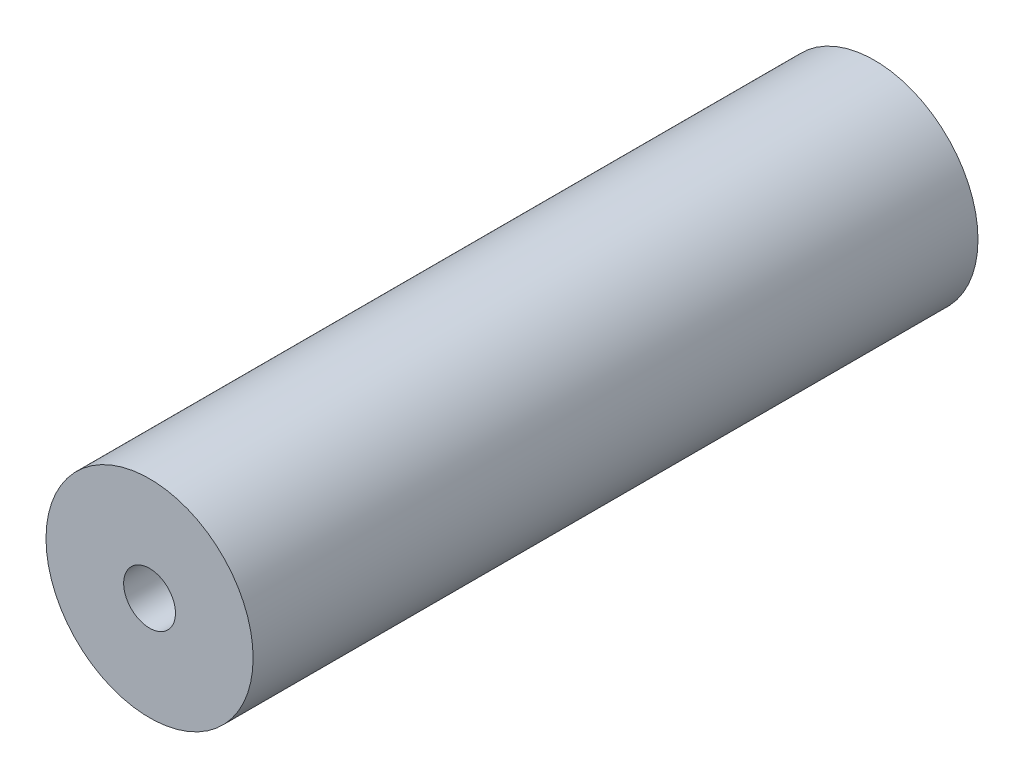
ISO-10303-21;
HEADER;
FILE_DESCRIPTION(('STEP AP214'),'2;1');
FILE_NAME('part.step','',(''),(''),'','','');
FILE_SCHEMA(('AUTOMOTIVE_DESIGN { 1 0 10303 214 1 1 1 1 }'));
ENDSEC;
DATA;
#1=APPLICATION_CONTEXT('core data for automotive mechanical design processes');
#2=APPLICATION_PROTOCOL_DEFINITION('international standard','automotive_design',2000,#1);
#3=PRODUCT_CONTEXT('',#1,'mechanical');
#4=PRODUCT('Part','Part','',(#3));
#5=PRODUCT_RELATED_PRODUCT_CATEGORY('part','',(#4));
#6=PRODUCT_DEFINITION_FORMATION('','',#4);
#7=PRODUCT_DEFINITION_CONTEXT('part definition',#1,'design');
#8=PRODUCT_DEFINITION('design','',#6,#7);
#9=PRODUCT_DEFINITION_SHAPE('','',#8);
#10=(LENGTH_UNIT() NAMED_UNIT(*) SI_UNIT(.MILLI.,.METRE.));
#11=(NAMED_UNIT(*) PLANE_ANGLE_UNIT() SI_UNIT($,.RADIAN.));
#12=(NAMED_UNIT(*) SI_UNIT($,.STERADIAN.) SOLID_ANGLE_UNIT());
#13=UNCERTAINTY_MEASURE_WITH_UNIT(LENGTH_MEASURE(1.E-05),#10,'distance_accuracy_value','');
#14=(GEOMETRIC_REPRESENTATION_CONTEXT(3) GLOBAL_UNCERTAINTY_ASSIGNED_CONTEXT((#13)) GLOBAL_UNIT_ASSIGNED_CONTEXT((#10,
#11,#12)) REPRESENTATION_CONTEXT('',''));
#15=CARTESIAN_POINT('',(0.,0.,0.));
#16=DIRECTION('',(0.,0.,1.));
#17=DIRECTION('',(1.,0.,0.));
#18=AXIS2_PLACEMENT_3D('',#15,#16,#17);
#19=CARTESIAN_POINT('',(0.,0.,177.8));
#20=DIRECTION('',(0.,0.,1.));
#21=DIRECTION('',(1.,0.,0.));
#22=AXIS2_PLACEMENT_3D('',#19,#20,#21);
#23=PLANE('',#22);
#24=CARTESIAN_POINT('',(0.,0.,177.8));
#25=DIRECTION('',(0.,0.,1.));
#26=DIRECTION('',(1.,0.,0.));
#27=AXIS2_PLACEMENT_3D('',#24,#25,#26);
#28=CIRCLE('',#27,25.4);
#29=CARTESIAN_POINT('',(25.4,0.,177.8));
#30=VERTEX_POINT('',#29);
#31=EDGE_CURVE('E10',#30,#30,#28,.T.);
#32=ORIENTED_EDGE('',*,*,#31,.T.);
#33=EDGE_LOOP('',(#32));
#34=FACE_BOUND('',#33,.T.);
#35=CARTESIAN_POINT('',(0.,0.,177.8));
#36=DIRECTION('',(0.,0.,1.));
#37=DIRECTION('',(1.,0.,0.));
#38=AXIS2_PLACEMENT_3D('',#35,#36,#37);
#39=CIRCLE('',#38,6.35);
#40=CARTESIAN_POINT('',(6.35,0.,177.8));
#41=VERTEX_POINT('',#40);
#42=EDGE_CURVE('E44',#41,#41,#39,.T.);
#43=ORIENTED_EDGE('',*,*,#42,.F.);
#44=EDGE_LOOP('',(#43));
#45=FACE_BOUND('',#44,.T.);
#46=ADVANCED_FACE('F33',(#34,#45),#23,.T.);
#47=CARTESIAN_POINT('',(0.,0.,0.));
#48=DIRECTION('',(0.,0.,1.));
#49=DIRECTION('',(1.,0.,0.));
#50=AXIS2_PLACEMENT_3D('',#47,#48,#49);
#51=PLANE('',#50);
#52=CARTESIAN_POINT('',(0.,0.,0.));
#53=DIRECTION('',(0.,0.,1.));
#54=DIRECTION('',(1.,0.,0.));
#55=AXIS2_PLACEMENT_3D('',#52,#53,#54);
#56=CIRCLE('',#55,25.4);
#57=CARTESIAN_POINT('',(25.4,0.,0.));
#58=VERTEX_POINT('',#57);
#59=EDGE_CURVE('E37',#58,#58,#56,.T.);
#60=ORIENTED_EDGE('',*,*,#59,.F.);
#61=EDGE_LOOP('',(#60));
#62=FACE_BOUND('',#61,.T.);
#63=CARTESIAN_POINT('',(0.,0.,0.));
#64=DIRECTION('',(0.,0.,1.));
#65=DIRECTION('',(1.,0.,0.));
#66=AXIS2_PLACEMENT_3D('',#63,#64,#65);
#67=CIRCLE('',#66,6.35);
#68=CARTESIAN_POINT('',(6.35,0.,0.));
#69=VERTEX_POINT('',#68);
#70=EDGE_CURVE('E46',#69,#69,#67,.T.);
#71=ORIENTED_EDGE('',*,*,#70,.T.);
#72=EDGE_LOOP('',(#71));
#73=FACE_BOUND('',#72,.T.);
#74=ADVANCED_FACE('F56',(#62,#73),#51,.F.);
#75=CARTESIAN_POINT('',(0.,0.,177.8));
#76=DIRECTION('',(0.,0.,-1.));
#77=DIRECTION('',(-1.,0.,0.));
#78=AXIS2_PLACEMENT_3D('',#75,#76,#77);
#79=CYLINDRICAL_SURFACE('',#78,25.4);
#80=ORIENTED_EDGE('',*,*,#31,.F.);
#81=EDGE_LOOP('',(#80));
#82=FACE_BOUND('',#81,.T.);
#83=ORIENTED_EDGE('',*,*,#59,.T.);
#84=EDGE_LOOP('',(#83));
#85=FACE_BOUND('',#84,.T.);
#86=ADVANCED_FACE('F35',(#82,#85),#79,.T.);
#87=CARTESIAN_POINT('',(0.,0.,177.8));
#88=DIRECTION('',(0.,0.,-1.));
#89=DIRECTION('',(-1.,0.,0.));
#90=AXIS2_PLACEMENT_3D('',#87,#88,#89);
#91=CYLINDRICAL_SURFACE('',#90,6.35);
#92=ORIENTED_EDGE('',*,*,#42,.T.);
#93=EDGE_LOOP('',(#92));
#94=FACE_BOUND('',#93,.T.);
#95=ORIENTED_EDGE('',*,*,#70,.F.);
#96=EDGE_LOOP('',(#95));
#97=FACE_BOUND('',#96,.T.);
#98=ADVANCED_FACE('F52',(#94,#97),#91,.F.);
#99=CLOSED_SHELL('',(#46,#74,#86,#98));
#100=MANIFOLD_SOLID_BREP('B2',#99);
#101=ADVANCED_BREP_SHAPE_REPRESENTATION('',(#18,#100),#14);
#102=SHAPE_DEFINITION_REPRESENTATION(#9,#101);
ENDSEC;
END-ISO-10303-21;
